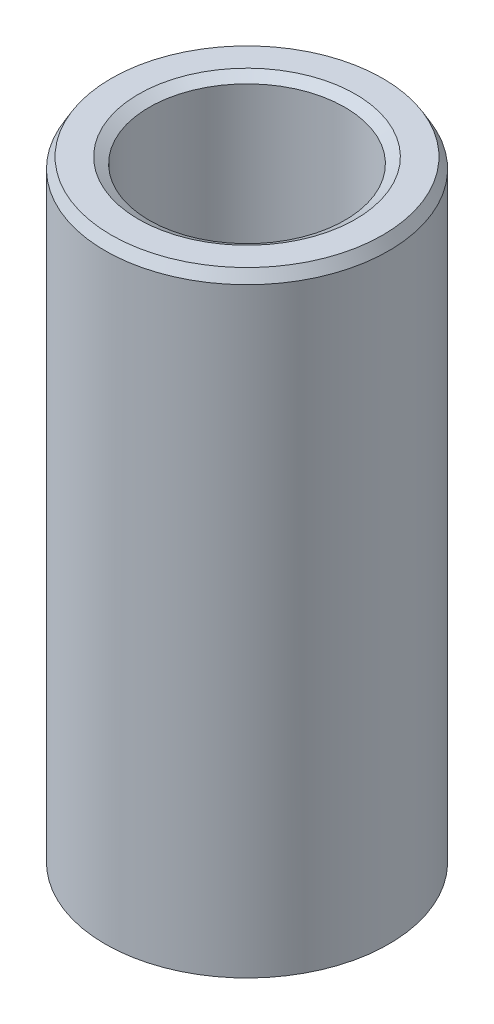
ISO-10303-21;
HEADER;
FILE_DESCRIPTION(('STEP AP214'),'2;1');
FILE_NAME('part.step','',(''),(''),'','','');
FILE_SCHEMA(('AUTOMOTIVE_DESIGN { 1 0 10303 214 1 1 1 1 }'));
ENDSEC;
DATA;
#1=APPLICATION_CONTEXT('core data for automotive mechanical design processes');
#2=APPLICATION_PROTOCOL_DEFINITION('international standard','automotive_design',2000,#1);
#3=PRODUCT_CONTEXT('',#1,'mechanical');
#4=PRODUCT('Part','Part','',(#3));
#5=PRODUCT_RELATED_PRODUCT_CATEGORY('part','',(#4));
#6=PRODUCT_DEFINITION_FORMATION('','',#4);
#7=PRODUCT_DEFINITION_CONTEXT('part definition',#1,'design');
#8=PRODUCT_DEFINITION('design','',#6,#7);
#9=PRODUCT_DEFINITION_SHAPE('','',#8);
#10=(LENGTH_UNIT() NAMED_UNIT(*) SI_UNIT(.MILLI.,.METRE.));
#11=(NAMED_UNIT(*) PLANE_ANGLE_UNIT() SI_UNIT($,.RADIAN.));
#12=(NAMED_UNIT(*) SI_UNIT($,.STERADIAN.) SOLID_ANGLE_UNIT());
#13=UNCERTAINTY_MEASURE_WITH_UNIT(LENGTH_MEASURE(1.E-05),#10,'distance_accuracy_value','');
#14=(GEOMETRIC_REPRESENTATION_CONTEXT(3) GLOBAL_UNCERTAINTY_ASSIGNED_CONTEXT((#13)) GLOBAL_UNIT_ASSIGNED_CONTEXT((#10,
#11,#12)) REPRESENTATION_CONTEXT('',''));
#15=CARTESIAN_POINT('',(0.,0.,0.));
#16=DIRECTION('',(0.,0.,1.));
#17=DIRECTION('',(1.,0.,0.));
#18=AXIS2_PLACEMENT_3D('',#15,#16,#17);
#19=CARTESIAN_POINT('',(0.,174.011662587175,0.));
#20=DIRECTION('',(0.,-1.,0.));
#21=DIRECTION('',(0.,0.,-1.));
#22=AXIS2_PLACEMENT_3D('',#19,#20,#21);
#23=CYLINDRICAL_SURFACE('',#22,40.);
#24=CARTESIAN_POINT('',(0.,1.71913459459727,0.));
#25=DIRECTION('',(0.,1.,0.));
#26=DIRECTION('',(0.,0.,1.));
#27=AXIS2_PLACEMENT_3D('',#24,#25,#26);
#28=CIRCLE('',#27,40.);
#29=CARTESIAN_POINT('',(0.,1.71913459459727,40.));
#30=VERTEX_POINT('',#29);
#31=EDGE_CURVE('E10',#30,#30,#28,.T.);
#32=ORIENTED_EDGE('',*,*,#31,.T.);
#33=EDGE_LOOP('',(#32));
#34=FACE_BOUND('',#33,.T.);
#35=CARTESIAN_POINT('',(0.,171.034034124283,0.));
#36=DIRECTION('',(0.,1.,0.));
#37=DIRECTION('',(0.,0.,1.));
#38=AXIS2_PLACEMENT_3D('',#35,#36,#37);
#39=CIRCLE('',#38,40.);
#40=CARTESIAN_POINT('',(0.,171.034034124283,-40.));
#41=VERTEX_POINT('',#40);
#42=EDGE_CURVE('E50',#41,#41,#39,.F.);
#43=ORIENTED_EDGE('',*,*,#42,.T.);
#44=EDGE_LOOP('',(#43));
#45=FACE_BOUND('',#44,.T.);
#46=ADVANCED_FACE('F39',(#34,#45),#23,.T.);
#47=CARTESIAN_POINT('',(0.,174.011662587175,0.));
#48=DIRECTION('',(0.,1.,0.));
#49=DIRECTION('',(0.,0.,1.));
#50=AXIS2_PLACEMENT_3D('',#47,#48,#49);
#51=PLANE('',#50);
#52=CARTESIAN_POINT('',(0.,174.011662587175,0.));
#53=DIRECTION('',(0.,1.,0.));
#54=DIRECTION('',(0.,0.,1.));
#55=AXIS2_PLACEMENT_3D('',#52,#53,#54);
#56=CIRCLE('',#55,30.5833407741423);
#57=CARTESIAN_POINT('',(0.,174.011662587175,30.5833407741423));
#58=VERTEX_POINT('',#57);
#59=EDGE_CURVE('E58',#58,#58,#56,.F.);
#60=ORIENTED_EDGE('',*,*,#59,.T.);
#61=EDGE_LOOP('',(#60));
#62=FACE_BOUND('',#61,.T.);
#63=CARTESIAN_POINT('',(0.,174.011662587175,0.));
#64=DIRECTION('',(0.,1.,0.));
#65=DIRECTION('',(0.,0.,1.));
#66=AXIS2_PLACEMENT_3D('',#63,#64,#65);
#67=CIRCLE('',#66,38.2808654054027);
#68=CARTESIAN_POINT('',(0.,174.011662587175,-38.2808654054027));
#69=VERTEX_POINT('',#68);
#70=EDGE_CURVE('E61',#69,#69,#67,.T.);
#71=ORIENTED_EDGE('',*,*,#70,.T.);
#72=EDGE_LOOP('',(#71));
#73=FACE_BOUND('',#72,.T.);
#74=ADVANCED_FACE('F88',(#62,#73),#51,.T.);
#75=CARTESIAN_POINT('',(0.,0.,0.));
#76=DIRECTION('',(0.,1.,0.));
#77=DIRECTION('',(0.,0.,1.));
#78=AXIS2_PLACEMENT_3D('',#75,#76,#77);
#79=PLANE('',#78);
#80=CARTESIAN_POINT('',(0.,0.,0.));
#81=DIRECTION('',(0.,1.,0.));
#82=DIRECTION('',(0.,0.,1.));
#83=AXIS2_PLACEMENT_3D('',#80,#81,#82);
#84=CIRCLE('',#83,29.3248469058478);
#85=CARTESIAN_POINT('',(0.,0.,-29.3248469058478));
#86=VERTEX_POINT('',#85);
#87=EDGE_CURVE('E51',#86,#86,#84,.T.);
#88=ORIENTED_EDGE('',*,*,#87,.T.);
#89=EDGE_LOOP('',(#88));
#90=FACE_BOUND('',#89,.T.);
#91=CARTESIAN_POINT('',(0.,0.,0.));
#92=DIRECTION('',(0.,1.,0.));
#93=DIRECTION('',(0.,0.,1.));
#94=AXIS2_PLACEMENT_3D('',#91,#92,#93);
#95=CIRCLE('',#94,37.0223715371082);
#96=CARTESIAN_POINT('',(0.,0.,37.0223715371082));
#97=VERTEX_POINT('',#96);
#98=EDGE_CURVE('E54',#97,#97,#95,.F.);
#99=ORIENTED_EDGE('',*,*,#98,.T.);
#100=EDGE_LOOP('',(#99));
#101=FACE_BOUND('',#100,.T.);
#102=ADVANCED_FACE('F83',(#90,#101),#79,.F.);
#103=CARTESIAN_POINT('',(0.,174.011662587175,0.));
#104=DIRECTION('',(0.,-1.,0.));
#105=DIRECTION('',(0.,0.,-1.));
#106=AXIS2_PLACEMENT_3D('',#103,#104,#105);
#107=CYLINDRICAL_SURFACE('',#106,27.6057123112505);
#108=CARTESIAN_POINT('',(0.,172.292527992577,0.));
#109=DIRECTION('',(0.,1.,0.));
#110=DIRECTION('',(0.,0.,1.));
#111=AXIS2_PLACEMENT_3D('',#108,#109,#110);
#112=CIRCLE('',#111,27.6057123112505);
#113=CARTESIAN_POINT('',(0.,172.292527992577,27.6057123112505));
#114=VERTEX_POINT('',#113);
#115=EDGE_CURVE('E67',#114,#114,#112,.T.);
#116=ORIENTED_EDGE('',*,*,#115,.T.);
#117=EDGE_LOOP('',(#116));
#118=FACE_BOUND('',#117,.T.);
#119=CARTESIAN_POINT('',(0.,2.97762846289179,0.));
#120=DIRECTION('',(0.,1.,0.));
#121=DIRECTION('',(0.,0.,1.));
#122=AXIS2_PLACEMENT_3D('',#119,#120,#121);
#123=CIRCLE('',#122,27.6057123112505);
#124=CARTESIAN_POINT('',(0.,2.97762846289179,-27.6057123112505));
#125=VERTEX_POINT('',#124);
#126=EDGE_CURVE('E69',#125,#125,#123,.F.);
#127=ORIENTED_EDGE('',*,*,#126,.T.);
#128=EDGE_LOOP('',(#127));
#129=FACE_BOUND('',#128,.T.);
#130=ADVANCED_FACE('F71',(#118,#129),#107,.F.);
#131=CARTESIAN_POINT('',(0.,172.292527992577,0.));
#132=DIRECTION('',(0.,1.,0.));
#133=DIRECTION('',(0.,0.,1.));
#134=AXIS2_PLACEMENT_3D('',#131,#132,#133);
#135=CONICAL_SURFACE('',#134,27.6057123112505,1.0471975511966);
#136=ORIENTED_EDGE('',*,*,#59,.F.);
#137=EDGE_LOOP('',(#136));
#138=FACE_BOUND('',#137,.T.);
#139=ORIENTED_EDGE('',*,*,#115,.F.);
#140=EDGE_LOOP('',(#139));
#141=FACE_BOUND('',#140,.T.);
#142=ADVANCED_FACE('F77',(#138,#141),#135,.F.);
#143=CARTESIAN_POINT('',(0.,0.,0.));
#144=DIRECTION('',(0.,-1.,0.));
#145=DIRECTION('',(0.,0.,-1.));
#146=AXIS2_PLACEMENT_3D('',#143,#144,#145);
#147=CONICAL_SURFACE('',#146,29.3248469058478,0.523598775598297);
#148=CARTESIAN_POINT('',(0.,2.97762846289179,-27.6057123112505));
#149=CARTESIAN_POINT('',(0.,2.94661149973667,-27.6236199632776));
#150=CARTESIAN_POINT('',(0.,2.91559453658154,-27.6415276153046));
#151=CARTESIAN_POINT('',(0.,2.8535606102713,-27.6773429193587));
#152=CARTESIAN_POINT('',(0.,2.82254364711618,-27.6952505713858));
#153=CARTESIAN_POINT('',(0.,2.76050972080593,-27.7310658754399));
#154=CARTESIAN_POINT('',(0.,2.72949275765081,-27.748973527467));
#155=CARTESIAN_POINT('',(0.,2.66745883134056,-27.7847888315211));
#156=CARTESIAN_POINT('',(0.,2.63644186818544,-27.8026964835481));
#157=CARTESIAN_POINT('',(0.,2.57440794187519,-27.8385117876022));
#158=CARTESIAN_POINT('',(0.,2.54339097872007,-27.8564194396293));
#159=CARTESIAN_POINT('',(0.,2.48135705240982,-27.8922347436834));
#160=CARTESIAN_POINT('',(0.,2.4503400892547,-27.9101423957104));
#161=CARTESIAN_POINT('',(0.,2.38830616294446,-27.9459576997646));
#162=CARTESIAN_POINT('',(0.,2.35728919978933,-27.9638653517916));
#163=CARTESIAN_POINT('',(0.,2.29525527347909,-27.9996806558457));
#164=CARTESIAN_POINT('',(0.,2.26423831032397,-28.0175883078728));
#165=CARTESIAN_POINT('',(0.,2.20220438401372,-28.0534036119269));
#166=CARTESIAN_POINT('',(0.,2.1711874208586,-28.0713112639539));
#167=CARTESIAN_POINT('',(0.,2.10915349454835,-28.107126568008));
#168=CARTESIAN_POINT('',(0.,2.07813653139323,-28.1250342200351));
#169=CARTESIAN_POINT('',(0.,2.01610260508298,-28.1608495240892));
#170=CARTESIAN_POINT('',(0.,1.98508564192786,-28.1787571761163));
#171=CARTESIAN_POINT('',(0.,1.92305171561761,-28.2145724801704));
#172=CARTESIAN_POINT('',(0.,1.89203475246249,-28.2324801321974));
#173=CARTESIAN_POINT('',(0.,1.83000082615225,-28.2682954362515));
#174=CARTESIAN_POINT('',(0.,1.79898386299712,-28.2862030882786));
#175=CARTESIAN_POINT('',(0.,1.73694993668688,-28.3220183923327));
#176=CARTESIAN_POINT('',(0.,1.70593297353175,-28.3399260443598));
#177=CARTESIAN_POINT('',(0.,1.64389904722151,-28.3757413484139));
#178=CARTESIAN_POINT('',(0.,1.61288208406639,-28.3936490004409));
#179=CARTESIAN_POINT('',(0.,1.55084815775614,-28.429464304495));
#180=CARTESIAN_POINT('',(0.,1.51983119460102,-28.4473719565221));
#181=CARTESIAN_POINT('',(0.,1.45779726829077,-28.4831872605762));
#182=CARTESIAN_POINT('',(0.,1.42678030513565,-28.5010949126033));
#183=CARTESIAN_POINT('',(0.,1.3647463788254,-28.5369102166574));
#184=CARTESIAN_POINT('',(0.,1.33372941567028,-28.5548178686844));
#185=CARTESIAN_POINT('',(0.,1.27169548936004,-28.5906331727385));
#186=CARTESIAN_POINT('',(0.,1.24067852620491,-28.6085408247656));
#187=CARTESIAN_POINT('',(0.,1.17864459989467,-28.6443561288197));
#188=CARTESIAN_POINT('',(0.,1.14762763673954,-28.6622637808467));
#189=CARTESIAN_POINT('',(0.,1.0855937104293,-28.6980790849009));
#190=CARTESIAN_POINT('',(0.,1.05457674727418,-28.7159867369279));
#191=CARTESIAN_POINT('',(0.,0.99254282096393,-28.751802040982));
#192=CARTESIAN_POINT('',(0.,0.961525857808807,-28.7697096930091));
#193=CARTESIAN_POINT('',(0.,0.899491931498562,-28.8055249970632));
#194=CARTESIAN_POINT('',(0.,0.868474968343439,-28.8234326490902));
#195=CARTESIAN_POINT('',(0.,0.806441042033193,-28.8592479531444));
#196=CARTESIAN_POINT('',(0.,0.77542407887807,-28.8771556051714));
#197=CARTESIAN_POINT('',(0.,0.713390152567825,-28.9129709092255));
#198=CARTESIAN_POINT('',(0.,0.682373189412702,-28.9308785612526));
#199=CARTESIAN_POINT('',(0.,0.620339263102456,-28.9666938653067));
#200=CARTESIAN_POINT('',(0.,0.589322299947334,-28.9846015173337));
#201=CARTESIAN_POINT('',(0.,0.527288373637088,-29.0204168213878));
#202=CARTESIAN_POINT('',(0.,0.496271410481965,-29.0383244734149));
#203=CARTESIAN_POINT('',(0.,0.434237484171719,-29.074139777469));
#204=CARTESIAN_POINT('',(0.,0.403220521016597,-29.0920474294961));
#205=CARTESIAN_POINT('',(0.,0.341186594706351,-29.1278627335502));
#206=CARTESIAN_POINT('',(0.,0.310169631551228,-29.1457703855772));
#207=CARTESIAN_POINT('',(0.,0.248135705240982,-29.1815856896313));
#208=CARTESIAN_POINT('',(0.,0.21711874208586,-29.1994933416584));
#209=CARTESIAN_POINT('',(0.,0.155084815775614,-29.2353086457125));
#210=CARTESIAN_POINT('',(0.,0.124067852620491,-29.2532162977396));
#211=CARTESIAN_POINT('',(0.,0.0620339263102456,-29.2890316017937));
#212=CARTESIAN_POINT('',(0.,0.0310169631551228,-29.3069392538207));
#213=CARTESIAN_POINT('',(0.,0.,-29.3248469058478));
#214=B_SPLINE_CURVE_WITH_KNOTS('',3,(#148,#149,#150,#151,#152,#153,#154,#155,#156,#157,#158,
#159,#160,#161,#162,#163,#164,#165,#166,#167,#168,#169,#170,#171,#172,#173,#174,#175,#176,#177,
#178,#179,#180,#181,#182,#183,#184,#185,#186,#187,#188,#189,#190,#191,#192,#193,#194,#195,#196,
#197,#198,#199,#200,#201,#202,#203,#204,#205,#206,#207,#208,#209,#210,#211,#212,#213),
.UNSPECIFIED.,.F.,.F.,(4,2,2,2,2,2,2,2,2,2,2,2,2,2,2,2,2,2,2,2,2,2,2,2,2,2,2,2,2,2,2,2,4),(0.,
0.107445912162329,0.214891824324658,0.322337736486988,0.429783648649317,0.537229560811645,
0.644675472973974,0.752121385136303,0.859567297298632,0.967013209460961,1.07445912162329,
1.18190503378562,1.28935094594795,1.39679685811028,1.50424277027261,1.61168868243494,
1.71913459459727,1.82658050675959,1.93402641892192,2.04147233108425,2.14891824324658,
2.25636415540891,2.36381006757124,2.47125597973357,2.5787018918959,2.68614780405823,
2.79359371622056,2.90103962838288,3.00848554054521,3.11593145270754,3.22337736486987,
3.3308232770322,3.43826918919453),.UNSPECIFIED.);
#215=EDGE_CURVE('BSEAM73',#125,#86,#214,.T.);
#216=ORIENTED_EDGE('',*,*,#126,.F.);
#217=ORIENTED_EDGE('',*,*,#87,.F.);
#218=ORIENTED_EDGE('',*,*,#215,.T.);
#219=ORIENTED_EDGE('',*,*,#215,.F.);
#220=EDGE_LOOP('',(#216,#218,#217,#219));
#221=FACE_BOUND('',#220,.T.);
#222=ADVANCED_FACE('F73',(#221),#147,.F.);
#223=CARTESIAN_POINT('',(0.,1.71913459459727,0.));
#224=DIRECTION('',(0.,1.,0.));
#225=DIRECTION('',(0.,0.,1.));
#226=AXIS2_PLACEMENT_3D('',#223,#224,#225);
#227=CONICAL_SURFACE('',#226,40.,1.0471975511966);
#228=ORIENTED_EDGE('',*,*,#98,.F.);
#229=EDGE_LOOP('',(#228));
#230=FACE_BOUND('',#229,.T.);
#231=ORIENTED_EDGE('',*,*,#31,.F.);
#232=EDGE_LOOP('',(#231));
#233=FACE_BOUND('',#232,.T.);
#234=ADVANCED_FACE('F76',(#230,#233),#227,.T.);
#235=CARTESIAN_POINT('',(0.,174.011662587175,0.));
#236=DIRECTION('',(0.,-1.,0.));
#237=DIRECTION('',(0.,0.,-1.));
#238=AXIS2_PLACEMENT_3D('',#235,#236,#237);
#239=CONICAL_SURFACE('',#238,38.2808654054027,0.523598775598305);
#240=CARTESIAN_POINT('',(0.,171.034034124283,-40.));
#241=CARTESIAN_POINT('',(0.,171.065051087438,-39.982092347973));
#242=CARTESIAN_POINT('',(0.,171.096068050593,-39.9641846959459));
#243=CARTESIAN_POINT('',(0.,171.158101976903,-39.9283693918918));
#244=CARTESIAN_POINT('',(0.,171.189118940059,-39.9104617398647));
#245=CARTESIAN_POINT('',(0.,171.251152866369,-39.8746464358106));
#246=CARTESIAN_POINT('',(0.,171.282169829524,-39.8567387837836));
#247=CARTESIAN_POINT('',(0.,171.344203755834,-39.8209234797295));
#248=CARTESIAN_POINT('',(0.,171.375220718989,-39.8030158277024));
#249=CARTESIAN_POINT('',(0.,171.4372546453,-39.7672005236483));
#250=CARTESIAN_POINT('',(0.,171.468271608455,-39.7492928716212));
#251=CARTESIAN_POINT('',(0.,171.530305534765,-39.7134775675671));
#252=CARTESIAN_POINT('',(0.,171.56132249792,-39.6955699155401));
#253=CARTESIAN_POINT('',(0.,171.62335642423,-39.659754611486));
#254=CARTESIAN_POINT('',(0.,171.654373387385,-39.6418469594589));
#255=CARTESIAN_POINT('',(0.,171.716407313696,-39.6060316554048));
#256=CARTESIAN_POINT('',(0.,171.747424276851,-39.5881240033777));
#257=CARTESIAN_POINT('',(0.,171.809458203161,-39.5523086993236));
#258=CARTESIAN_POINT('',(0.,171.840475166316,-39.5344010472966));
#259=CARTESIAN_POINT('',(0.,171.902509092626,-39.4985857432425));
#260=CARTESIAN_POINT('',(0.,171.933526055781,-39.4806780912154));
#261=CARTESIAN_POINT('',(0.,171.995559982092,-39.4448627871613));
#262=CARTESIAN_POINT('',(0.,172.026576945247,-39.4269551351342));
#263=CARTESIAN_POINT('',(0.,172.088610871557,-39.3911398310801));
#264=CARTESIAN_POINT('',(0.,172.119627834712,-39.3732321790531));
#265=CARTESIAN_POINT('',(0.,172.181661761022,-39.337416874999));
#266=CARTESIAN_POINT('',(0.,172.212678724178,-39.3195092229719));
#267=CARTESIAN_POINT('',(0.,172.274712650488,-39.2836939189178));
#268=CARTESIAN_POINT('',(0.,172.305729613643,-39.2657862668907));
#269=CARTESIAN_POINT('',(0.,172.367763539953,-39.2299709628366));
#270=CARTESIAN_POINT('',(0.,172.398780503108,-39.2120633108096));
#271=CARTESIAN_POINT('',(0.,172.460814429419,-39.1762480067555));
#272=CARTESIAN_POINT('',(0.,172.491831392574,-39.1583403547284));
#273=CARTESIAN_POINT('',(0.,172.553865318884,-39.1225250506743));
#274=CARTESIAN_POINT('',(0.,172.584882282039,-39.1046173986473));
#275=CARTESIAN_POINT('',(0.,172.646916208349,-39.0688020945931));
#276=CARTESIAN_POINT('',(0.,172.677933171504,-39.0508944425661));
#277=CARTESIAN_POINT('',(0.,172.739967097815,-39.015079138512));
#278=CARTESIAN_POINT('',(0.,172.77098406097,-38.9971714864849));
#279=CARTESIAN_POINT('',(0.,172.83301798728,-38.9613561824308));
#280=CARTESIAN_POINT('',(0.,172.864034950435,-38.9434485304038));
#281=CARTESIAN_POINT('',(0.,172.926068876745,-38.9076332263496));
#282=CARTESIAN_POINT('',(0.,172.957085839901,-38.8897255743226));
#283=CARTESIAN_POINT('',(0.,173.019119766211,-38.8539102702685));
#284=CARTESIAN_POINT('',(0.,173.050136729366,-38.8360026182414));
#285=CARTESIAN_POINT('',(0.,173.112170655676,-38.8001873141873));
#286=CARTESIAN_POINT('',(0.,173.143187618831,-38.7822796621603));
#287=CARTESIAN_POINT('',(0.,173.205221545142,-38.7464643581062));
#288=CARTESIAN_POINT('',(0.,173.236238508297,-38.7285567060791));
#289=CARTESIAN_POINT('',(0.,173.298272434607,-38.692741402025));
#290=CARTESIAN_POINT('',(0.,173.329289397762,-38.6748337499979));
#291=CARTESIAN_POINT('',(0.,173.391323324072,-38.6390184459438));
#292=CARTESIAN_POINT('',(0.,173.422340287227,-38.6211107939168));
#293=CARTESIAN_POINT('',(0.,173.484374213538,-38.5852954898627));
#294=CARTESIAN_POINT('',(0.,173.515391176693,-38.5673878378356));
#295=CARTESIAN_POINT('',(0.,173.577425103003,-38.5315725337815));
#296=CARTESIAN_POINT('',(0.,173.608442066158,-38.5136648817544));
#297=CARTESIAN_POINT('',(0.,173.670475992468,-38.4778495777003));
#298=CARTESIAN_POINT('',(0.,173.701492955623,-38.4599419256733));
#299=CARTESIAN_POINT('',(0.,173.763526881934,-38.4241266216192));
#300=CARTESIAN_POINT('',(0.,173.794543845089,-38.4062189695921));
#301=CARTESIAN_POINT('',(0.,173.856577771399,-38.370403665538));
#302=CARTESIAN_POINT('',(0.,173.887594734554,-38.3524960135109));
#303=CARTESIAN_POINT('',(0.,173.949628660864,-38.3166807094568));
#304=CARTESIAN_POINT('',(0.,173.98064562402,-38.2987730574298));
#305=CARTESIAN_POINT('',(0.,174.011662587175,-38.2808654054027));
#306=B_SPLINE_CURVE_WITH_KNOTS('',3,(#240,#241,#242,#243,#244,#245,#246,#247,#248,#249,#250,
#251,#252,#253,#254,#255,#256,#257,#258,#259,#260,#261,#262,#263,#264,#265,#266,#267,#268,#269,
#270,#271,#272,#273,#274,#275,#276,#277,#278,#279,#280,#281,#282,#283,#284,#285,#286,#287,#288,
#289,#290,#291,#292,#293,#294,#295,#296,#297,#298,#299,#300,#301,#302,#303,#304,#305),
.UNSPECIFIED.,.F.,.F.,(4,2,2,2,2,2,2,2,2,2,2,2,2,2,2,2,2,2,2,2,2,2,2,2,2,2,2,2,2,2,2,2,4),(0.,
0.107445912162334,0.214891824324668,0.322337736487001,0.429783648649335,0.537229560811669,
0.644675472973979,0.752121385136312,0.85956729729865,0.967013209460983,1.07445912162332,
1.18190503378563,1.28935094594796,1.39679685811029,1.50424277027263,1.61168868243496,
1.71913459459727,1.82658050675961,1.93402641892194,2.04147233108428,2.14891824324661,
2.25636415540894,2.36381006757125,2.47125597973359,2.57870189189592,2.68614780405826,
2.79359371622059,2.9010396283829,3.00848554054523,3.11593145270757,3.2233773648699,
3.33082327703224,3.43826918919457),.UNSPECIFIED.);
#307=EDGE_CURVE('BSEAM45',#41,#69,#306,.T.);
#308=ORIENTED_EDGE('',*,*,#42,.F.);
#309=ORIENTED_EDGE('',*,*,#70,.F.);
#310=ORIENTED_EDGE('',*,*,#307,.T.);
#311=ORIENTED_EDGE('',*,*,#307,.F.);
#312=EDGE_LOOP('',(#308,#310,#309,#311));
#313=FACE_BOUND('',#312,.T.);
#314=ADVANCED_FACE('F45',(#313),#239,.T.);
#315=CLOSED_SHELL('',(#46,#74,#102,#130,#142,#222,#234,#314));
#316=MANIFOLD_SOLID_BREP('B2',#315);
#317=ADVANCED_BREP_SHAPE_REPRESENTATION('',(#18,#316),#14);
#318=SHAPE_DEFINITION_REPRESENTATION(#9,#317);
ENDSEC;
END-ISO-10303-21;
